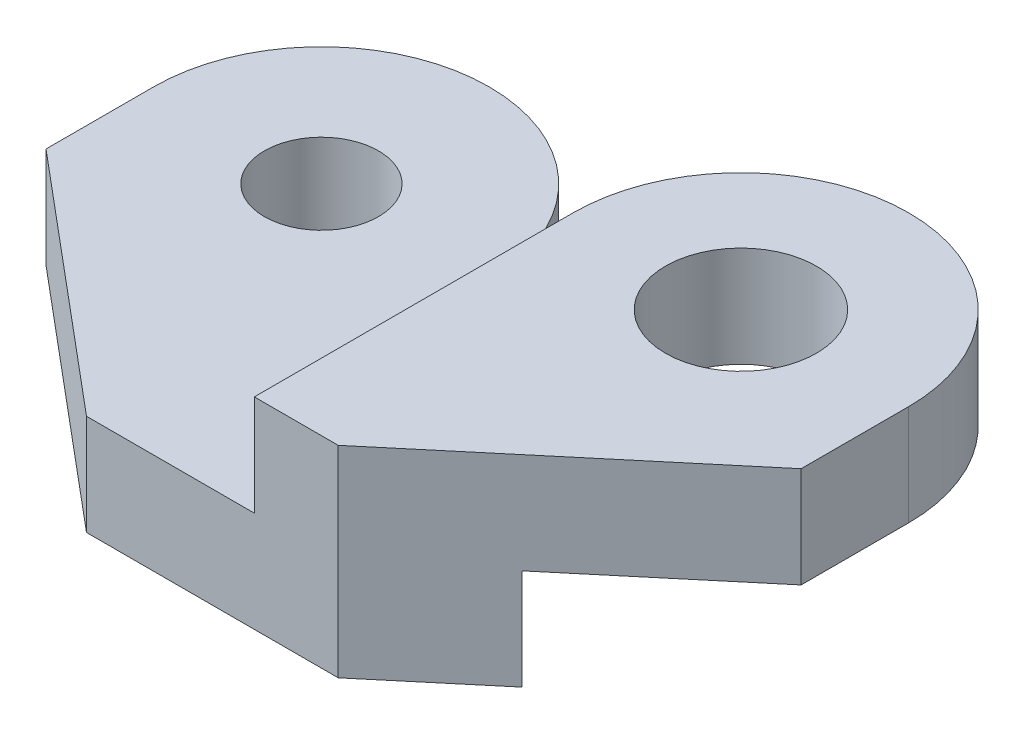
ISO-10303-21;
HEADER;
FILE_DESCRIPTION(('STEP AP214'),'2;1');
FILE_NAME('part.step','',(''),(''),'','','');
FILE_SCHEMA(('AUTOMOTIVE_DESIGN { 1 0 10303 214 1 1 1 1 }'));
ENDSEC;
DATA;
#1=APPLICATION_CONTEXT('core data for automotive mechanical design processes');
#2=APPLICATION_PROTOCOL_DEFINITION('international standard','automotive_design',2000,#1);
#3=PRODUCT_CONTEXT('',#1,'mechanical');
#4=PRODUCT('Part','Part','',(#3));
#5=PRODUCT_RELATED_PRODUCT_CATEGORY('part','',(#4));
#6=PRODUCT_DEFINITION_FORMATION('','',#4);
#7=PRODUCT_DEFINITION_CONTEXT('part definition',#1,'design');
#8=PRODUCT_DEFINITION('design','',#6,#7);
#9=PRODUCT_DEFINITION_SHAPE('','',#8);
#10=(LENGTH_UNIT() NAMED_UNIT(*) SI_UNIT(.MILLI.,.METRE.));
#11=(NAMED_UNIT(*) PLANE_ANGLE_UNIT() SI_UNIT($,.RADIAN.));
#12=(NAMED_UNIT(*) SI_UNIT($,.STERADIAN.) SOLID_ANGLE_UNIT());
#13=UNCERTAINTY_MEASURE_WITH_UNIT(LENGTH_MEASURE(1.E-05),#10,'distance_accuracy_value','');
#14=(GEOMETRIC_REPRESENTATION_CONTEXT(3) GLOBAL_UNCERTAINTY_ASSIGNED_CONTEXT((#13)) GLOBAL_UNIT_ASSIGNED_CONTEXT((#10,
#11,#12)) REPRESENTATION_CONTEXT('',''));
#15=CARTESIAN_POINT('',(0.,0.,0.));
#16=DIRECTION('',(0.,0.,1.));
#17=DIRECTION('',(1.,0.,0.));
#18=AXIS2_PLACEMENT_3D('',#15,#16,#17);
#19=CARTESIAN_POINT('',(10.,0.,0.));
#20=DIRECTION('',(0.,1.,0.));
#21=DIRECTION('',(0.,0.,1.));
#22=AXIS2_PLACEMENT_3D('',#19,#20,#21);
#23=PLANE('',#22);
#24=CARTESIAN_POINT('',(9.99999999999999,0.,-30.));
#25=DIRECTION('',(0.,1.,0.));
#26=DIRECTION('',(0.,0.,1.));
#27=AXIS2_PLACEMENT_3D('',#24,#25,#26);
#28=CIRCLE('',#27,4.5);
#29=CARTESIAN_POINT('',(9.99999999999999,0.,-25.5));
#30=VERTEX_POINT('',#29);
#31=EDGE_CURVE('E207',#30,#30,#28,.T.);
#32=ORIENTED_EDGE('',*,*,#31,.T.);
#33=EDGE_LOOP('',(#32));
#34=FACE_BOUND('',#33,.T.);
#35=DIRECTION('',(0.766044443118974,0.,-0.642787609686544));
#36=VECTOR('',#35,1.);
#37=CARTESIAN_POINT('',(2.51767780260014,0.,-8.91708435969858));
#38=LINE('',#37,#36);
#39=CARTESIAN_POINT('',(10.958767962971,0.,-16.));
#40=VERTEX_POINT('',#39);
#41=CARTESIAN_POINT('',(20.,0.,-23.5864944676593));
#42=VERTEX_POINT('',#41);
#43=EDGE_CURVE('E216',#40,#42,#38,.T.);
#44=ORIENTED_EDGE('',*,*,#43,.F.);
#45=DIRECTION('',(1.,0.,0.));
#46=VECTOR('',#45,1.);
#47=CARTESIAN_POINT('',(-5.,0.,-16.));
#48=LINE('',#47,#46);
#49=CARTESIAN_POINT('',(0.,0.,-16.));
#50=VERTEX_POINT('',#49);
#51=EDGE_CURVE('E230',#50,#40,#48,.T.);
#52=ORIENTED_EDGE('',*,*,#51,.F.);
#53=DIRECTION('',(0.,0.,1.));
#54=VECTOR('',#53,1.);
#55=CARTESIAN_POINT('',(0.,0.,-30.));
#56=LINE('',#55,#54);
#57=CARTESIAN_POINT('',(0.,0.,-30.));
#58=VERTEX_POINT('',#57);
#59=EDGE_CURVE('E160',#58,#50,#56,.T.);
#60=ORIENTED_EDGE('',*,*,#59,.F.);
#61=CARTESIAN_POINT('',(9.99999999999999,0.,-30.));
#62=DIRECTION('',(0.,1.,0.));
#63=DIRECTION('',(0.,0.,1.));
#64=AXIS2_PLACEMENT_3D('',#61,#62,#63);
#65=CIRCLE('',#64,10.);
#66=CARTESIAN_POINT('',(20.,0.,-30.));
#67=VERTEX_POINT('',#66);
#68=EDGE_CURVE('E154',#67,#58,#65,.T.);
#69=ORIENTED_EDGE('',*,*,#68,.F.);
#70=DIRECTION('',(0.,0.,1.));
#71=VECTOR('',#70,1.);
#72=CARTESIAN_POINT('',(20.,0.,-30.));
#73=LINE('',#72,#71);
#74=EDGE_CURVE('E210',#67,#42,#73,.T.);
#75=ORIENTED_EDGE('',*,*,#74,.T.);
#76=EDGE_LOOP('',(#44,#52,#60,#69,#75));
#77=FACE_BOUND('',#76,.T.);
#78=ADVANCED_FACE('F48',(#34,#77),#23,.F.);
#79=CARTESIAN_POINT('',(20.,6.,-30.));
#80=DIRECTION('',(-1.,0.,0.));
#81=DIRECTION('',(0.,0.,1.));
#82=AXIS2_PLACEMENT_3D('',#79,#80,#81);
#83=PLANE('',#82);
#84=DIRECTION('',(0.,-1.,0.));
#85=VECTOR('',#84,1.);
#86=CARTESIAN_POINT('',(20.,6.,-23.5864944676593));
#87=LINE('',#86,#85);
#88=CARTESIAN_POINT('',(20.,6.,-23.5864944676593));
#89=VERTEX_POINT('',#88);
#90=EDGE_CURVE('E136',#89,#42,#87,.T.);
#91=ORIENTED_EDGE('',*,*,#90,.T.);
#92=ORIENTED_EDGE('',*,*,#74,.F.);
#93=DIRECTION('',(0.,-1.,0.));
#94=VECTOR('',#93,1.);
#95=CARTESIAN_POINT('',(20.,6.,-30.));
#96=LINE('',#95,#94);
#97=CARTESIAN_POINT('',(20.,6.,-30.));
#98=VERTEX_POINT('',#97);
#99=EDGE_CURVE('E171',#98,#67,#96,.T.);
#100=ORIENTED_EDGE('',*,*,#99,.F.);
#101=DIRECTION('',(0.,0.,-1.));
#102=VECTOR('',#101,1.);
#103=CARTESIAN_POINT('',(20.,6.,-30.));
#104=LINE('',#103,#102);
#105=EDGE_CURVE('E158',#89,#98,#104,.T.);
#106=ORIENTED_EDGE('',*,*,#105,.F.);
#107=EDGE_LOOP('',(#91,#92,#100,#106));
#108=FACE_BOUND('',#107,.T.);
#109=ADVANCED_FACE('F50',(#108),#83,.F.);
#110=CARTESIAN_POINT('',(10.,6.,0.));
#111=DIRECTION('',(0.,1.,0.));
#112=DIRECTION('',(0.,0.,1.));
#113=AXIS2_PLACEMENT_3D('',#110,#111,#112);
#114=PLANE('',#113);
#115=CARTESIAN_POINT('',(9.99999999999999,6.,-30.));
#116=DIRECTION('',(0.,1.,0.));
#117=DIRECTION('',(0.,0.,1.));
#118=AXIS2_PLACEMENT_3D('',#115,#116,#117);
#119=CIRCLE('',#118,4.5);
#120=CARTESIAN_POINT('',(9.99999999999999,6.,-25.5));
#121=VERTEX_POINT('',#120);
#122=EDGE_CURVE('E204',#121,#121,#119,.T.);
#123=ORIENTED_EDGE('',*,*,#122,.F.);
#124=EDGE_LOOP('',(#123));
#125=FACE_BOUND('',#124,.T.);
#126=DIRECTION('',(1.,0.,0.));
#127=VECTOR('',#126,1.);
#128=CARTESIAN_POINT('',(0.,6.,-11.));
#129=LINE('',#128,#127);
#130=CARTESIAN_POINT('',(0.,6.,-11.));
#131=VERTEX_POINT('',#130);
#132=CARTESIAN_POINT('',(5.,6.,-11.));
#133=VERTEX_POINT('',#132);
#134=EDGE_CURVE('E146',#131,#133,#129,.T.);
#135=ORIENTED_EDGE('',*,*,#134,.T.);
#136=DIRECTION('',(-0.766044443118975,0.,0.642787609686544));
#137=VECTOR('',#136,1.);
#138=CARTESIAN_POINT('',(5.,6.,-11.));
#139=LINE('',#138,#137);
#140=EDGE_CURVE('E131',#89,#133,#139,.T.);
#141=ORIENTED_EDGE('',*,*,#140,.F.);
#142=ORIENTED_EDGE('',*,*,#105,.T.);
#143=CARTESIAN_POINT('',(9.99999999999999,6.,-30.));
#144=DIRECTION('',(0.,1.,0.));
#145=DIRECTION('',(0.,0.,1.));
#146=AXIS2_PLACEMENT_3D('',#143,#144,#145);
#147=CIRCLE('',#146,10.);
#148=CARTESIAN_POINT('',(0.,6.,-30.));
#149=VERTEX_POINT('',#148);
#150=EDGE_CURVE('E165',#98,#149,#147,.T.);
#151=ORIENTED_EDGE('',*,*,#150,.T.);
#152=DIRECTION('',(0.,0.,1.));
#153=VECTOR('',#152,1.);
#154=CARTESIAN_POINT('',(0.,6.,0.));
#155=LINE('',#154,#153);
#156=EDGE_CURVE('E153',#149,#131,#155,.T.);
#157=ORIENTED_EDGE('',*,*,#156,.T.);
#158=EDGE_LOOP('',(#135,#141,#142,#151,#157));
#159=FACE_BOUND('',#158,.T.);
#160=ADVANCED_FACE('F151',(#125,#159),#114,.T.);
#161=CARTESIAN_POINT('',(0.,-6.,-19.));
#162=DIRECTION('',(0.,1.,0.));
#163=DIRECTION('',(0.,0.,1.));
#164=AXIS2_PLACEMENT_3D('',#161,#162,#163);
#165=PLANE('',#164);
#166=CARTESIAN_POINT('',(-15.,-6.,-30.));
#167=DIRECTION('',(0.,1.,0.));
#168=DIRECTION('',(0.,0.,1.));
#169=AXIS2_PLACEMENT_3D('',#166,#167,#168);
#170=CIRCLE('',#169,3.4);
#171=CARTESIAN_POINT('',(-15.,-6.,-26.6));
#172=VERTEX_POINT('',#171);
#173=EDGE_CURVE('E239',#172,#172,#170,.T.);
#174=ORIENTED_EDGE('',*,*,#173,.T.);
#175=EDGE_LOOP('',(#174));
#176=FACE_BOUND('',#175,.T.);
#177=DIRECTION('',(0.766044443118974,0.,-0.642787609686544));
#178=VECTOR('',#177,1.);
#179=CARTESIAN_POINT('',(6.00511056788154,-6.,-11.8433879068018));
#180=LINE('',#179,#178);
#181=CARTESIAN_POINT('',(5.,-6.,-11.));
#182=VERTEX_POINT('',#181);
#183=CARTESIAN_POINT('',(10.958767962971,-6.,-16.));
#184=VERTEX_POINT('',#183);
#185=EDGE_CURVE('E62',#182,#184,#180,.T.);
#186=ORIENTED_EDGE('',*,*,#185,.F.);
#187=DIRECTION('',(-1.,0.,0.));
#188=VECTOR('',#187,1.);
#189=CARTESIAN_POINT('',(0.,-6.,-11.));
#190=LINE('',#189,#188);
#191=CARTESIAN_POINT('',(-10.,-6.,-11.));
#192=VERTEX_POINT('',#191);
#193=EDGE_CURVE('E149',#182,#192,#190,.T.);
#194=ORIENTED_EDGE('',*,*,#193,.T.);
#195=DIRECTION('',(-0.766044443118975,0.,-0.642787609686544));
#196=VECTOR('',#195,1.);
#197=CARTESIAN_POINT('',(-8.07099012371425,-6.,-9.38136852427127));
#198=LINE('',#197,#196);
#199=CARTESIAN_POINT('',(-25.,-6.,-23.5864944676593));
#200=VERTEX_POINT('',#199);
#201=EDGE_CURVE('E176',#192,#200,#198,.T.);
#202=ORIENTED_EDGE('',*,*,#201,.T.);
#203=DIRECTION('',(0.,0.,1.));
#204=VECTOR('',#203,1.);
#205=CARTESIAN_POINT('',(-25.,-6.,-19.));
#206=LINE('',#205,#204);
#207=CARTESIAN_POINT('',(-25.,-6.,-30.));
#208=VERTEX_POINT('',#207);
#209=EDGE_CURVE('E183',#208,#200,#206,.T.);
#210=ORIENTED_EDGE('',*,*,#209,.F.);
#211=CARTESIAN_POINT('',(-15.,-6.,-30.));
#212=DIRECTION('',(0.,-1.,0.));
#213=DIRECTION('',(0.,0.,-1.));
#214=AXIS2_PLACEMENT_3D('',#211,#212,#213);
#215=CIRCLE('',#214,10.);
#216=CARTESIAN_POINT('',(-5.,-6.,-30.));
#217=VERTEX_POINT('',#216);
#218=EDGE_CURVE('E242',#208,#217,#215,.T.);
#219=ORIENTED_EDGE('',*,*,#218,.T.);
#220=DIRECTION('',(0.,0.,1.));
#221=VECTOR('',#220,1.);
#222=CARTESIAN_POINT('',(-5.,-6.,-19.));
#223=LINE('',#222,#221);
#224=CARTESIAN_POINT('',(-5.,-6.,-16.));
#225=VERTEX_POINT('',#224);
#226=EDGE_CURVE('E247',#217,#225,#223,.T.);
#227=ORIENTED_EDGE('',*,*,#226,.T.);
#228=DIRECTION('',(-1.,0.,0.));
#229=VECTOR('',#228,1.);
#230=CARTESIAN_POINT('',(-5.,-6.,-16.));
#231=LINE('',#230,#229);
#232=EDGE_CURVE('E234',#184,#225,#231,.T.);
#233=ORIENTED_EDGE('',*,*,#232,.F.);
#234=EDGE_LOOP('',(#186,#194,#202,#210,#219,#227,#233));
#235=FACE_BOUND('',#234,.T.);
#236=ADVANCED_FACE('F181',(#176,#235),#165,.F.);
#237=CARTESIAN_POINT('',(0.,6.,-11.));
#238=DIRECTION('',(0.,0.,-1.));
#239=DIRECTION('',(-1.,0.,0.));
#240=AXIS2_PLACEMENT_3D('',#237,#238,#239);
#241=PLANE('',#240);
#242=DIRECTION('',(0.,-1.,0.));
#243=VECTOR('',#242,1.);
#244=CARTESIAN_POINT('',(5.,6.,-11.));
#245=LINE('',#244,#243);
#246=EDGE_CURVE('E134',#133,#182,#245,.T.);
#247=ORIENTED_EDGE('',*,*,#246,.F.);
#248=ORIENTED_EDGE('',*,*,#134,.F.);
#249=DIRECTION('',(0.,1.,0.));
#250=VECTOR('',#249,1.);
#251=CARTESIAN_POINT('',(0.,6.,-11.));
#252=LINE('',#251,#250);
#253=CARTESIAN_POINT('',(0.,0.,-11.));
#254=VERTEX_POINT('',#253);
#255=EDGE_CURVE('E155',#254,#131,#252,.T.);
#256=ORIENTED_EDGE('',*,*,#255,.F.);
#257=DIRECTION('',(1.,0.,0.));
#258=VECTOR('',#257,1.);
#259=CARTESIAN_POINT('',(-25.,0.,-11.));
#260=LINE('',#259,#258);
#261=CARTESIAN_POINT('',(-10.,0.,-11.));
#262=VERTEX_POINT('',#261);
#263=EDGE_CURVE('E194',#262,#254,#260,.T.);
#264=ORIENTED_EDGE('',*,*,#263,.F.);
#265=DIRECTION('',(0.,-1.,0.));
#266=VECTOR('',#265,1.);
#267=CARTESIAN_POINT('',(-10.,6.,-11.));
#268=LINE('',#267,#266);
#269=EDGE_CURVE('E225',#262,#192,#268,.T.);
#270=ORIENTED_EDGE('',*,*,#269,.T.);
#271=ORIENTED_EDGE('',*,*,#193,.F.);
#272=EDGE_LOOP('',(#247,#248,#256,#264,#270,#271));
#273=FACE_BOUND('',#272,.T.);
#274=ADVANCED_FACE('F144',(#273),#241,.F.);
#275=CARTESIAN_POINT('',(0.,0.,-16.));
#276=DIRECTION('',(0.,0.,1.));
#277=DIRECTION('',(1.,0.,0.));
#278=AXIS2_PLACEMENT_3D('',#275,#276,#277);
#279=PLANE('',#278);
#280=DIRECTION('',(0.,1.,0.));
#281=VECTOR('',#280,1.);
#282=CARTESIAN_POINT('',(10.958767962971,0.,-16.));
#283=LINE('',#282,#281);
#284=EDGE_CURVE('E13',#184,#40,#283,.T.);
#285=ORIENTED_EDGE('',*,*,#284,.F.);
#286=ORIENTED_EDGE('',*,*,#232,.T.);
#287=DIRECTION('',(0.,1.,0.));
#288=VECTOR('',#287,1.);
#289=CARTESIAN_POINT('',(-5.,0.,-16.));
#290=LINE('',#289,#288);
#291=CARTESIAN_POINT('',(-5.,0.,-16.));
#292=VERTEX_POINT('',#291);
#293=EDGE_CURVE('E185',#225,#292,#290,.T.);
#294=ORIENTED_EDGE('',*,*,#293,.T.);
#295=EDGE_CURVE('E231',#292,#50,#48,.T.);
#296=ORIENTED_EDGE('',*,*,#295,.T.);
#297=ORIENTED_EDGE('',*,*,#51,.T.);
#298=EDGE_LOOP('',(#285,#286,#294,#296,#297));
#299=FACE_BOUND('',#298,.T.);
#300=ADVANCED_FACE('F262',(#299),#279,.F.);
#301=CARTESIAN_POINT('',(0.,6.,0.));
#302=DIRECTION('',(1.,0.,0.));
#303=DIRECTION('',(0.,0.,-1.));
#304=AXIS2_PLACEMENT_3D('',#301,#302,#303);
#305=PLANE('',#304);
#306=DIRECTION('',(0.,0.,-1.));
#307=VECTOR('',#306,1.);
#308=CARTESIAN_POINT('',(0.,0.,-19.));
#309=LINE('',#308,#307);
#310=EDGE_CURVE('E192',#254,#50,#309,.T.);
#311=ORIENTED_EDGE('',*,*,#310,.F.);
#312=ORIENTED_EDGE('',*,*,#255,.T.);
#313=ORIENTED_EDGE('',*,*,#156,.F.);
#314=DIRECTION('',(0.,-1.,0.));
#315=VECTOR('',#314,1.);
#316=CARTESIAN_POINT('',(0.,6.,-30.));
#317=LINE('',#316,#315);
#318=EDGE_CURVE('E167',#149,#58,#317,.T.);
#319=ORIENTED_EDGE('',*,*,#318,.T.);
#320=ORIENTED_EDGE('',*,*,#59,.T.);
#321=EDGE_LOOP('',(#311,#312,#313,#319,#320));
#322=FACE_BOUND('',#321,.T.);
#323=ADVANCED_FACE('F268',(#322),#305,.F.);
#324=CARTESIAN_POINT('',(9.99999999999999,6.,-30.));
#325=DIRECTION('',(0.,-1.,0.));
#326=DIRECTION('',(0.,0.,-1.));
#327=AXIS2_PLACEMENT_3D('',#324,#325,#326);
#328=CYLINDRICAL_SURFACE('',#327,10.);
#329=ORIENTED_EDGE('',*,*,#68,.T.);
#330=ORIENTED_EDGE('',*,*,#318,.F.);
#331=ORIENTED_EDGE('',*,*,#150,.F.);
#332=ORIENTED_EDGE('',*,*,#99,.T.);
#333=EDGE_LOOP('',(#329,#330,#331,#332));
#334=FACE_BOUND('',#333,.T.);
#335=ADVANCED_FACE('F271',(#334),#328,.T.);
#336=CARTESIAN_POINT('',(9.99999999999999,6.,-30.));
#337=DIRECTION('',(0.,1.,0.));
#338=DIRECTION('',(0.,0.,1.));
#339=AXIS2_PLACEMENT_3D('',#336,#337,#338);
#340=CYLINDRICAL_SURFACE('',#339,4.5);
#341=ORIENTED_EDGE('',*,*,#122,.T.);
#342=EDGE_LOOP('',(#341));
#343=FACE_BOUND('',#342,.T.);
#344=ORIENTED_EDGE('',*,*,#31,.F.);
#345=EDGE_LOOP('',(#344));
#346=FACE_BOUND('',#345,.T.);
#347=ADVANCED_FACE('F273',(#343,#346),#340,.F.);
#348=CARTESIAN_POINT('',(-25.,0.,-19.));
#349=DIRECTION('',(0.,-1.,0.));
#350=DIRECTION('',(0.,0.,-1.));
#351=AXIS2_PLACEMENT_3D('',#348,#349,#350);
#352=PLANE('',#351);
#353=CARTESIAN_POINT('',(-15.,0.,-30.));
#354=DIRECTION('',(0.,1.,0.));
#355=DIRECTION('',(0.,0.,1.));
#356=AXIS2_PLACEMENT_3D('',#353,#354,#355);
#357=CIRCLE('',#356,3.4);
#358=CARTESIAN_POINT('',(-15.,0.,-26.6));
#359=VERTEX_POINT('',#358);
#360=EDGE_CURVE('E236',#359,#359,#357,.T.);
#361=ORIENTED_EDGE('',*,*,#360,.F.);
#362=EDGE_LOOP('',(#361));
#363=FACE_BOUND('',#362,.T.);
#364=DIRECTION('',(0.,0.,-1.));
#365=VECTOR('',#364,1.);
#366=CARTESIAN_POINT('',(-25.,0.,-19.));
#367=LINE('',#366,#365);
#368=CARTESIAN_POINT('',(-25.,0.,-23.5864944676593));
#369=VERTEX_POINT('',#368);
#370=CARTESIAN_POINT('',(-25.,0.,-30.));
#371=VERTEX_POINT('',#370);
#372=EDGE_CURVE('E191',#369,#371,#367,.T.);
#373=ORIENTED_EDGE('',*,*,#372,.F.);
#374=DIRECTION('',(0.766044443118975,0.,0.642787609686544));
#375=VECTOR('',#374,1.);
#376=CARTESIAN_POINT('',(-22.7415923445507,0.,-21.6914654369239));
#377=LINE('',#376,#375);
#378=EDGE_CURVE('E70',#369,#262,#377,.T.);
#379=ORIENTED_EDGE('',*,*,#378,.T.);
#380=ORIENTED_EDGE('',*,*,#263,.T.);
#381=ORIENTED_EDGE('',*,*,#310,.T.);
#382=ORIENTED_EDGE('',*,*,#295,.F.);
#383=DIRECTION('',(0.,0.,1.));
#384=VECTOR('',#383,1.);
#385=CARTESIAN_POINT('',(-5.,0.,-19.));
#386=LINE('',#385,#384);
#387=CARTESIAN_POINT('',(-5.,0.,-30.));
#388=VERTEX_POINT('',#387);
#389=EDGE_CURVE('E246',#388,#292,#386,.T.);
#390=ORIENTED_EDGE('',*,*,#389,.F.);
#391=CARTESIAN_POINT('',(-15.,0.,-30.));
#392=DIRECTION('',(0.,-1.,0.));
#393=DIRECTION('',(0.,0.,-1.));
#394=AXIS2_PLACEMENT_3D('',#391,#392,#393);
#395=CIRCLE('',#394,10.);
#396=EDGE_CURVE('E243',#371,#388,#395,.T.);
#397=ORIENTED_EDGE('',*,*,#396,.F.);
#398=EDGE_LOOP('',(#373,#379,#380,#381,#382,#390,#397));
#399=FACE_BOUND('',#398,.T.);
#400=ADVANCED_FACE('F264',(#363,#399),#352,.F.);
#401=CARTESIAN_POINT('',(-25.,0.,0.));
#402=DIRECTION('',(-1.,0.,0.));
#403=DIRECTION('',(0.,0.,1.));
#404=AXIS2_PLACEMENT_3D('',#401,#402,#403);
#405=PLANE('',#404);
#406=DIRECTION('',(0.,-1.,0.));
#407=VECTOR('',#406,1.);
#408=CARTESIAN_POINT('',(-25.,0.,-23.5864944676593));
#409=LINE('',#408,#407);
#410=EDGE_CURVE('E56',#369,#200,#409,.T.);
#411=ORIENTED_EDGE('',*,*,#410,.F.);
#412=ORIENTED_EDGE('',*,*,#372,.T.);
#413=DIRECTION('',(0.,-1.,0.));
#414=VECTOR('',#413,1.);
#415=CARTESIAN_POINT('',(-25.,0.,-30.));
#416=LINE('',#415,#414);
#417=EDGE_CURVE('E189',#371,#208,#416,.T.);
#418=ORIENTED_EDGE('',*,*,#417,.T.);
#419=ORIENTED_EDGE('',*,*,#209,.T.);
#420=EDGE_LOOP('',(#411,#412,#418,#419));
#421=FACE_BOUND('',#420,.T.);
#422=ADVANCED_FACE('F187',(#421),#405,.T.);
#423=CARTESIAN_POINT('',(-5.,0.,-19.));
#424=DIRECTION('',(1.,0.,0.));
#425=DIRECTION('',(0.,0.,-1.));
#426=AXIS2_PLACEMENT_3D('',#423,#424,#425);
#427=PLANE('',#426);
#428=ORIENTED_EDGE('',*,*,#226,.F.);
#429=DIRECTION('',(0.,-1.,0.));
#430=VECTOR('',#429,1.);
#431=CARTESIAN_POINT('',(-5.,0.,-30.));
#432=LINE('',#431,#430);
#433=EDGE_CURVE('E197',#388,#217,#432,.T.);
#434=ORIENTED_EDGE('',*,*,#433,.F.);
#435=ORIENTED_EDGE('',*,*,#389,.T.);
#436=ORIENTED_EDGE('',*,*,#293,.F.);
#437=EDGE_LOOP('',(#428,#434,#435,#436));
#438=FACE_BOUND('',#437,.T.);
#439=ADVANCED_FACE('F259',(#438),#427,.T.);
#440=CARTESIAN_POINT('',(-15.,0.,-30.));
#441=DIRECTION('',(0.,-1.,0.));
#442=DIRECTION('',(0.,0.,-1.));
#443=AXIS2_PLACEMENT_3D('',#440,#441,#442);
#444=CYLINDRICAL_SURFACE('',#443,10.);
#445=ORIENTED_EDGE('',*,*,#218,.F.);
#446=ORIENTED_EDGE('',*,*,#417,.F.);
#447=ORIENTED_EDGE('',*,*,#396,.T.);
#448=ORIENTED_EDGE('',*,*,#433,.T.);
#449=EDGE_LOOP('',(#445,#446,#447,#448));
#450=FACE_BOUND('',#449,.T.);
#451=ADVANCED_FACE('F252',(#450),#444,.T.);
#452=CARTESIAN_POINT('',(-15.,0.,-30.));
#453=DIRECTION('',(0.,1.,0.));
#454=DIRECTION('',(0.,0.,1.));
#455=AXIS2_PLACEMENT_3D('',#452,#453,#454);
#456=CYLINDRICAL_SURFACE('',#455,3.4);
#457=ORIENTED_EDGE('',*,*,#173,.F.);
#458=EDGE_LOOP('',(#457));
#459=FACE_BOUND('',#458,.T.);
#460=ORIENTED_EDGE('',*,*,#360,.T.);
#461=EDGE_LOOP('',(#460));
#462=FACE_BOUND('',#461,.T.);
#463=ADVANCED_FACE('F303',(#459,#462),#456,.F.);
#464=CARTESIAN_POINT('',(-10.,6.,-11.));
#465=DIRECTION('',(0.642787609686543,0.,-0.766044443118974));
#466=DIRECTION('',(-0.766044443118975,0.,-0.642787609686544));
#467=AXIS2_PLACEMENT_3D('',#464,#465,#466);
#468=PLANE('',#467);
#469=ORIENTED_EDGE('',*,*,#269,.F.);
#470=ORIENTED_EDGE('',*,*,#378,.F.);
#471=ORIENTED_EDGE('',*,*,#410,.T.);
#472=ORIENTED_EDGE('',*,*,#201,.F.);
#473=EDGE_LOOP('',(#469,#470,#471,#472));
#474=FACE_BOUND('',#473,.T.);
#475=ADVANCED_FACE('F175',(#474),#468,.F.);
#476=CARTESIAN_POINT('',(5.,6.,-11.));
#477=DIRECTION('',(0.642787609686544,0.,0.766044443118974));
#478=DIRECTION('',(0.766044443118974,0.,-0.642787609686544));
#479=AXIS2_PLACEMENT_3D('',#476,#477,#478);
#480=PLANE('',#479);
#481=ORIENTED_EDGE('',*,*,#43,.T.);
#482=ORIENTED_EDGE('',*,*,#90,.F.);
#483=ORIENTED_EDGE('',*,*,#140,.T.);
#484=ORIENTED_EDGE('',*,*,#246,.T.);
#485=ORIENTED_EDGE('',*,*,#185,.T.);
#486=ORIENTED_EDGE('',*,*,#284,.T.);
#487=EDGE_LOOP('',(#481,#482,#483,#484,#485,#486));
#488=FACE_BOUND('',#487,.T.);
#489=ADVANCED_FACE('F133',(#488),#480,.T.);
#490=CLOSED_SHELL('',(#78,#109,#160,#236,#274,#300,#323,#335,#347,#400,#422,#439,#451,#463,#475,#489));
#491=MANIFOLD_SOLID_BREP('B2',#490);
#492=ADVANCED_BREP_SHAPE_REPRESENTATION('',(#18,#491),#14);
#493=SHAPE_DEFINITION_REPRESENTATION(#9,#492);
ENDSEC;
END-ISO-10303-21;
